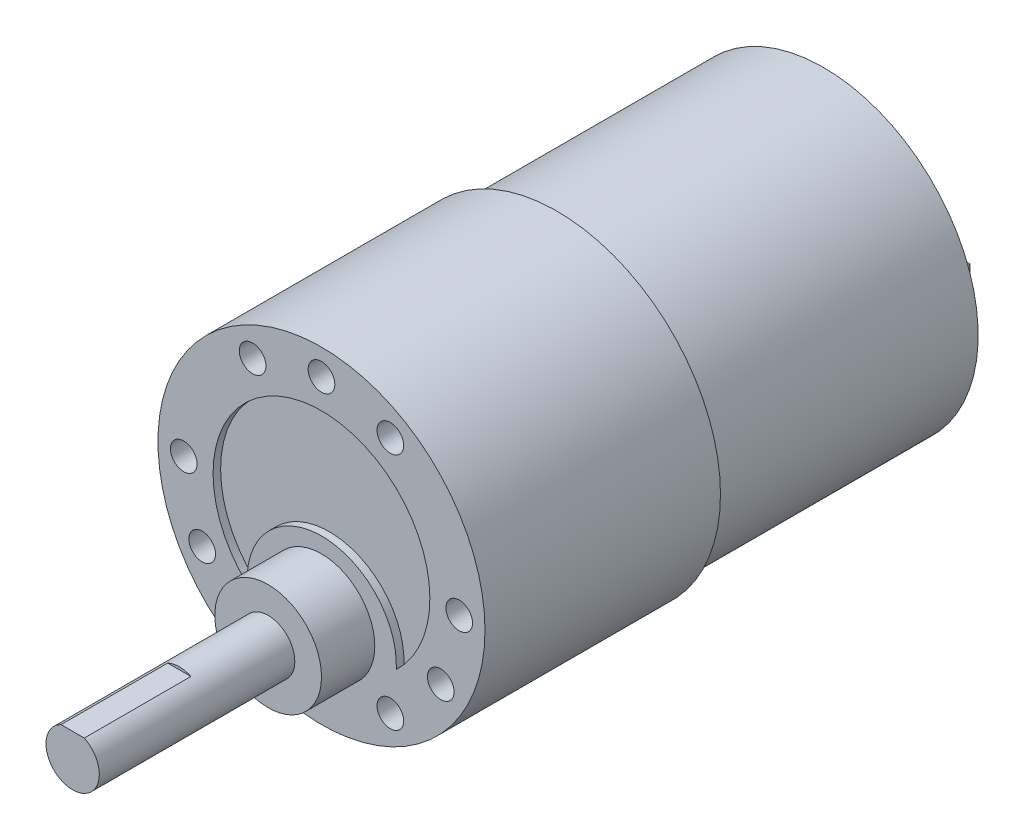
ISO-10303-21;
HEADER;
FILE_DESCRIPTION(('STEP AP214'),'2;1');
FILE_NAME('part.step','',(''),(''),'','','');
FILE_SCHEMA(('AUTOMOTIVE_DESIGN { 1 0 10303 214 1 1 1 1 }'));
ENDSEC;
DATA;
#1=APPLICATION_CONTEXT('core data for automotive mechanical design processes');
#2=APPLICATION_PROTOCOL_DEFINITION('international standard','automotive_design',2000,#1);
#3=PRODUCT_CONTEXT('',#1,'mechanical');
#4=PRODUCT('Part','Part','',(#3));
#5=PRODUCT_RELATED_PRODUCT_CATEGORY('part','',(#4));
#6=PRODUCT_DEFINITION_FORMATION('','',#4);
#7=PRODUCT_DEFINITION_CONTEXT('part definition',#1,'design');
#8=PRODUCT_DEFINITION('design','',#6,#7);
#9=PRODUCT_DEFINITION_SHAPE('','',#8);
#10=(LENGTH_UNIT() NAMED_UNIT(*) SI_UNIT(.MILLI.,.METRE.));
#11=(NAMED_UNIT(*) PLANE_ANGLE_UNIT() SI_UNIT($,.RADIAN.));
#12=(NAMED_UNIT(*) SI_UNIT($,.STERADIAN.) SOLID_ANGLE_UNIT());
#13=UNCERTAINTY_MEASURE_WITH_UNIT(LENGTH_MEASURE(1.E-05),#10,'distance_accuracy_value','');
#14=(GEOMETRIC_REPRESENTATION_CONTEXT(3) GLOBAL_UNCERTAINTY_ASSIGNED_CONTEXT((#13)) GLOBAL_UNIT_ASSIGNED_CONTEXT((#10,
#11,#12)) REPRESENTATION_CONTEXT('',''));
#15=CARTESIAN_POINT('',(0.,0.,0.));
#16=DIRECTION('',(0.,0.,1.));
#17=DIRECTION('',(1.,0.,0.));
#18=AXIS2_PLACEMENT_3D('',#15,#16,#17);
#19=CARTESIAN_POINT('',(0.,0.,-30.));
#20=DIRECTION('',(0.,0.,-1.));
#21=DIRECTION('',(-1.,0.,0.));
#22=AXIS2_PLACEMENT_3D('',#19,#20,#21);
#23=PLANE('',#22);
#24=CARTESIAN_POINT('',(11.25,0.,-30.));
#25=DIRECTION('',(0.,0.,-1.));
#26=DIRECTION('',(-1.,0.,0.));
#27=AXIS2_PLACEMENT_3D('',#24,#25,#26);
#28=CIRCLE('',#27,2.25);
#29=CARTESIAN_POINT('',(9.,0.,-30.));
#30=VERTEX_POINT('',#29);
#31=EDGE_CURVE('E227',#30,#30,#28,.T.);
#32=ORIENTED_EDGE('',*,*,#31,.F.);
#33=EDGE_LOOP('',(#32));
#34=FACE_BOUND('',#33,.T.);
#35=CARTESIAN_POINT('',(0.,0.,-30.));
#36=DIRECTION('',(0.,0.,-1.));
#37=DIRECTION('',(-1.,0.,0.));
#38=AXIS2_PLACEMENT_3D('',#35,#36,#37);
#39=CIRCLE('',#38,3.9);
#40=CARTESIAN_POINT('',(-3.9,0.,-30.));
#41=VERTEX_POINT('',#40);
#42=EDGE_CURVE('E14',#41,#41,#39,.T.);
#43=ORIENTED_EDGE('',*,*,#42,.F.);
#44=EDGE_LOOP('',(#43));
#45=FACE_BOUND('',#44,.T.);
#46=CARTESIAN_POINT('',(0.,0.,-30.));
#47=DIRECTION('',(0.,0.,-1.));
#48=DIRECTION('',(-1.,0.,0.));
#49=AXIS2_PLACEMENT_3D('',#46,#47,#48);
#50=CIRCLE('',#49,17.4);
#51=CARTESIAN_POINT('',(-17.4,0.,-30.));
#52=VERTEX_POINT('',#51);
#53=EDGE_CURVE('E235',#52,#52,#50,.T.);
#54=ORIENTED_EDGE('',*,*,#53,.T.);
#55=EDGE_LOOP('',(#54));
#56=FACE_BOUND('',#55,.T.);
#57=CARTESIAN_POINT('',(-11.25,0.,-30.));
#58=DIRECTION('',(0.,0.,-1.));
#59=DIRECTION('',(1.,0.,0.));
#60=AXIS2_PLACEMENT_3D('',#57,#58,#59);
#61=CIRCLE('',#60,2.25);
#62=CARTESIAN_POINT('',(-9.,0.,-30.));
#63=VERTEX_POINT('',#62);
#64=EDGE_CURVE('E209',#63,#63,#61,.T.);
#65=ORIENTED_EDGE('',*,*,#64,.F.);
#66=EDGE_LOOP('',(#65));
#67=FACE_BOUND('',#66,.T.);
#68=ADVANCED_FACE('F58',(#34,#45,#56,#67),#23,.T.);
#69=CARTESIAN_POINT('',(0.,0.,26.5));
#70=DIRECTION('',(0.,0.,-1.));
#71=DIRECTION('',(-1.,0.,0.));
#72=AXIS2_PLACEMENT_3D('',#69,#70,#71);
#73=CYLINDRICAL_SURFACE('',#72,18.4);
#74=CARTESIAN_POINT('',(0.,0.,26.5));
#75=DIRECTION('',(0.,0.,1.));
#76=DIRECTION('',(1.,0.,0.));
#77=AXIS2_PLACEMENT_3D('',#74,#75,#76);
#78=CIRCLE('',#77,18.4);
#79=CARTESIAN_POINT('',(18.4,0.,26.5));
#80=VERTEX_POINT('',#79);
#81=EDGE_CURVE('E259',#80,#80,#78,.T.);
#82=ORIENTED_EDGE('',*,*,#81,.F.);
#83=EDGE_LOOP('',(#82));
#84=FACE_BOUND('',#83,.T.);
#85=CARTESIAN_POINT('',(0.,0.,0.));
#86=DIRECTION('',(0.,0.,1.));
#87=DIRECTION('',(1.,0.,0.));
#88=AXIS2_PLACEMENT_3D('',#85,#86,#87);
#89=CIRCLE('',#88,18.4);
#90=CARTESIAN_POINT('',(18.4,0.,0.));
#91=VERTEX_POINT('',#90);
#92=EDGE_CURVE('E62',#91,#91,#89,.T.);
#93=ORIENTED_EDGE('',*,*,#92,.T.);
#94=EDGE_LOOP('',(#93));
#95=FACE_BOUND('',#94,.T.);
#96=ADVANCED_FACE('F60',(#84,#95),#73,.T.);
#97=CARTESIAN_POINT('',(0.,0.,26.5));
#98=DIRECTION('',(0.,0.,1.));
#99=DIRECTION('',(1.,0.,0.));
#100=AXIS2_PLACEMENT_3D('',#97,#98,#99);
#101=PLANE('',#100);
#102=CARTESIAN_POINT('',(-1.78589781851884E-12,-7.75000000000207,26.5));
#103=DIRECTION('',(0.,0.,1.));
#104=DIRECTION('',(1.,0.,0.));
#105=AXIS2_PLACEMENT_3D('',#102,#103,#104);
#106=CIRCLE('',#105,6.);
#107=CARTESIAN_POINT('',(5.99999999999821,-7.75000000000207,26.5));
#108=VERTEX_POINT('',#107);
#109=EDGE_CURVE('E256',#108,#108,#106,.T.);
#110=ORIENTED_EDGE('',*,*,#109,.F.);
#111=EDGE_LOOP('',(#110));
#112=FACE_BOUND('',#111,.T.);
#113=CARTESIAN_POINT('',(-15.5,0.,26.5));
#114=DIRECTION('',(0.,0.,1.));
#115=DIRECTION('',(1.,0.,0.));
#116=AXIS2_PLACEMENT_3D('',#113,#114,#115);
#117=CIRCLE('',#116,1.5);
#118=CARTESIAN_POINT('',(-14.,0.,26.5));
#119=VERTEX_POINT('',#118);
#120=EDGE_CURVE('E270',#119,#119,#117,.T.);
#121=ORIENTED_EDGE('',*,*,#120,.F.);
#122=EDGE_LOOP('',(#121));
#123=FACE_BOUND('',#122,.T.);
#124=CARTESIAN_POINT('',(-7.75000000000016,-13.4233937586587,26.5));
#125=DIRECTION('',(0.,0.,1.));
#126=DIRECTION('',(1.,0.,0.));
#127=AXIS2_PLACEMENT_3D('',#124,#125,#126);
#128=CIRCLE('',#127,1.5);
#129=CARTESIAN_POINT('',(-6.25000000000015,-13.4233937586587,26.5));
#130=VERTEX_POINT('',#129);
#131=EDGE_CURVE('E263',#130,#130,#128,.T.);
#132=ORIENTED_EDGE('',*,*,#131,.F.);
#133=EDGE_LOOP('',(#132));
#134=FACE_BOUND('',#133,.T.);
#135=CARTESIAN_POINT('',(7.74999999999987,-13.4233937586589,26.5));
#136=DIRECTION('',(0.,0.,1.));
#137=DIRECTION('',(1.,0.,0.));
#138=AXIS2_PLACEMENT_3D('',#135,#136,#137);
#139=CIRCLE('',#138,1.5);
#140=CARTESIAN_POINT('',(9.24999999999988,-13.4233937586589,26.5));
#141=VERTEX_POINT('',#140);
#142=EDGE_CURVE('E277',#141,#141,#139,.T.);
#143=ORIENTED_EDGE('',*,*,#142,.F.);
#144=EDGE_LOOP('',(#143));
#145=FACE_BOUND('',#144,.T.);
#146=CARTESIAN_POINT('',(15.5,-1.08235921504137E-13,26.5));
#147=DIRECTION('',(0.,0.,1.));
#148=DIRECTION('',(1.,0.,0.));
#149=AXIS2_PLACEMENT_3D('',#146,#147,#148);
#150=CIRCLE('',#149,1.5);
#151=CARTESIAN_POINT('',(17.,-1.08235921504137E-13,26.5));
#152=VERTEX_POINT('',#151);
#153=EDGE_CURVE('E294',#152,#152,#150,.T.);
#154=ORIENTED_EDGE('',*,*,#153,.F.);
#155=EDGE_LOOP('',(#154));
#156=FACE_BOUND('',#155,.T.);
#157=CARTESIAN_POINT('',(7.75000000000006,13.4233937586588,26.5));
#158=DIRECTION('',(0.,0.,1.));
#159=DIRECTION('',(1.,0.,0.));
#160=AXIS2_PLACEMENT_3D('',#157,#158,#159);
#161=CIRCLE('',#160,1.5);
#162=CARTESIAN_POINT('',(9.25000000000006,13.4233937586588,26.5));
#163=VERTEX_POINT('',#162);
#164=EDGE_CURVE('E288',#163,#163,#161,.T.);
#165=ORIENTED_EDGE('',*,*,#164,.F.);
#166=EDGE_LOOP('',(#165));
#167=FACE_BOUND('',#166,.T.);
#168=CARTESIAN_POINT('',(-7.74999999999997,13.4233937586588,26.5));
#169=DIRECTION('',(0.,0.,1.));
#170=DIRECTION('',(1.,0.,0.));
#171=AXIS2_PLACEMENT_3D('',#168,#169,#170);
#172=CIRCLE('',#171,1.5);
#173=CARTESIAN_POINT('',(-6.24999999999997,13.4233937586588,26.5));
#174=VERTEX_POINT('',#173);
#175=EDGE_CURVE('E282',#174,#174,#172,.T.);
#176=ORIENTED_EDGE('',*,*,#175,.F.);
#177=EDGE_LOOP('',(#176));
#178=FACE_BOUND('',#177,.T.);
#179=CARTESIAN_POINT('',(0.,15.5,26.5));
#180=DIRECTION('',(0.,0.,1.));
#181=DIRECTION('',(1.,0.,0.));
#182=AXIS2_PLACEMENT_3D('',#179,#180,#181);
#183=CIRCLE('',#182,1.5);
#184=CARTESIAN_POINT('',(1.5,15.5,26.5));
#185=VERTEX_POINT('',#184);
#186=EDGE_CURVE('E306',#185,#185,#183,.T.);
#187=ORIENTED_EDGE('',*,*,#186,.F.);
#188=EDGE_LOOP('',(#187));
#189=FACE_BOUND('',#188,.T.);
#190=CARTESIAN_POINT('',(13.4233937586576,-7.75000000000207,26.5));
#191=DIRECTION('',(0.,0.,1.));
#192=DIRECTION('',(1.,0.,0.));
#193=AXIS2_PLACEMENT_3D('',#190,#191,#192);
#194=CIRCLE('',#193,1.49999999999779);
#195=CARTESIAN_POINT('',(14.9233937586554,-7.75000000000207,26.5));
#196=VERTEX_POINT('',#195);
#197=EDGE_CURVE('E312',#196,#196,#194,.T.);
#198=ORIENTED_EDGE('',*,*,#197,.F.);
#199=EDGE_LOOP('',(#198));
#200=FACE_BOUND('',#199,.T.);
#201=CARTESIAN_POINT('',(-13.4233937586612,-7.74999999999587,26.5));
#202=DIRECTION('',(0.,0.,1.));
#203=DIRECTION('',(1.,0.,0.));
#204=AXIS2_PLACEMENT_3D('',#201,#202,#203);
#205=CIRCLE('',#204,1.49999999999558);
#206=CARTESIAN_POINT('',(-11.9233937586656,-7.74999999999587,26.5));
#207=VERTEX_POINT('',#206);
#208=EDGE_CURVE('E269',#207,#207,#205,.T.);
#209=ORIENTED_EDGE('',*,*,#208,.F.);
#210=EDGE_LOOP('',(#209));
#211=FACE_BOUND('',#210,.T.);
#212=CARTESIAN_POINT('',(0.0300122031200254,-8.39994638480889,26.5));
#213=DIRECTION('',(0.,0.,1.));
#214=DIRECTION('',(1.,0.,0.));
#215=AXIS2_PLACEMENT_3D('',#212,#213,#214);
#216=CIRCLE('',#215,8.4);
#217=CARTESIAN_POINT('',(-8.35571384552702,-8.88943452260424,26.5));
#218=VERTEX_POINT('',#217);
#219=CARTESIAN_POINT('',(8.41902189984086,-8.8295,26.5));
#220=VERTEX_POINT('',#219);
#221=EDGE_CURVE('E83',#218,#220,#216,.F.);
#222=ORIENTED_EDGE('',*,*,#221,.F.);
#223=CARTESIAN_POINT('',(0.,0.,26.5));
#224=DIRECTION('',(0.,0.,1.));
#225=DIRECTION('',(1.,0.,0.));
#226=AXIS2_PLACEMENT_3D('',#223,#224,#225);
#227=CIRCLE('',#226,12.2);
#228=EDGE_CURVE('E305',#220,#218,#227,.T.);
#229=ORIENTED_EDGE('',*,*,#228,.F.);
#230=EDGE_LOOP('',(#222,#229));
#231=FACE_BOUND('',#230,.T.);
#232=ORIENTED_EDGE('',*,*,#81,.T.);
#233=EDGE_LOOP('',(#232));
#234=FACE_BOUND('',#233,.T.);
#235=ADVANCED_FACE('F342',(#112,#123,#134,#145,#156,#167,#178,#189,#200,#211,#231,#234),#101,.T.);
#236=CARTESIAN_POINT('',(0.,0.,0.));
#237=DIRECTION('',(0.,0.,1.));
#238=DIRECTION('',(1.,0.,0.));
#239=AXIS2_PLACEMENT_3D('',#236,#237,#238);
#240=PLANE('',#239);
#241=CARTESIAN_POINT('',(0.,0.,0.));
#242=DIRECTION('',(0.,0.,-1.));
#243=DIRECTION('',(-1.,0.,0.));
#244=AXIS2_PLACEMENT_3D('',#241,#242,#243);
#245=CIRCLE('',#244,17.4);
#246=CARTESIAN_POINT('',(-17.4,0.,0.));
#247=VERTEX_POINT('',#246);
#248=EDGE_CURVE('E67',#247,#247,#245,.T.);
#249=ORIENTED_EDGE('',*,*,#248,.F.);
#250=EDGE_LOOP('',(#249));
#251=FACE_BOUND('',#250,.T.);
#252=ORIENTED_EDGE('',*,*,#92,.F.);
#253=EDGE_LOOP('',(#252));
#254=FACE_BOUND('',#253,.T.);
#255=ADVANCED_FACE('F339',(#251,#254),#240,.F.);
#256=CARTESIAN_POINT('',(0.0300122031200254,-8.39994638480889,25.65));
#257=DIRECTION('',(0.,0.,1.));
#258=DIRECTION('',(1.,0.,0.));
#259=AXIS2_PLACEMENT_3D('',#256,#257,#258);
#260=CYLINDRICAL_SURFACE('',#259,8.4);
#261=ORIENTED_EDGE('',*,*,#221,.T.);
#262=DIRECTION('',(0.,0.,1.));
#263=VECTOR('',#262,1.);
#264=CARTESIAN_POINT('',(8.41902189984086,-8.8295,25.65));
#265=LINE('',#264,#263);
#266=CARTESIAN_POINT('',(8.41902189984086,-8.8295,25.65));
#267=VERTEX_POINT('',#266);
#268=EDGE_CURVE('E330',#267,#220,#265,.T.);
#269=ORIENTED_EDGE('',*,*,#268,.F.);
#270=CARTESIAN_POINT('',(0.0300122031200254,-8.39994638480889,25.65));
#271=DIRECTION('',(0.,0.,1.));
#272=DIRECTION('',(1.,0.,0.));
#273=AXIS2_PLACEMENT_3D('',#270,#271,#272);
#274=CIRCLE('',#273,8.4);
#275=CARTESIAN_POINT('',(-8.35571384552702,-8.88943452260424,25.65));
#276=VERTEX_POINT('',#275);
#277=EDGE_CURVE('E323',#276,#267,#274,.F.);
#278=ORIENTED_EDGE('',*,*,#277,.F.);
#279=DIRECTION('',(0.,0.,1.));
#280=VECTOR('',#279,1.);
#281=CARTESIAN_POINT('',(-8.35571384552702,-8.88943452260424,25.65));
#282=LINE('',#281,#280);
#283=EDGE_CURVE('E326',#276,#218,#282,.T.);
#284=ORIENTED_EDGE('',*,*,#283,.T.);
#285=EDGE_LOOP('',(#261,#269,#278,#284));
#286=FACE_BOUND('',#285,.T.);
#287=ADVANCED_FACE('F341',(#286),#260,.T.);
#288=CARTESIAN_POINT('',(0.,0.,25.65));
#289=DIRECTION('',(0.,0.,1.));
#290=DIRECTION('',(1.,0.,0.));
#291=AXIS2_PLACEMENT_3D('',#288,#289,#290);
#292=CYLINDRICAL_SURFACE('',#291,12.2);
#293=ORIENTED_EDGE('',*,*,#228,.T.);
#294=ORIENTED_EDGE('',*,*,#283,.F.);
#295=CARTESIAN_POINT('',(0.,0.,25.65));
#296=DIRECTION('',(0.,0.,1.));
#297=DIRECTION('',(1.,0.,0.));
#298=AXIS2_PLACEMENT_3D('',#295,#296,#297);
#299=CIRCLE('',#298,12.2);
#300=EDGE_CURVE('E320',#267,#276,#299,.T.);
#301=ORIENTED_EDGE('',*,*,#300,.F.);
#302=ORIENTED_EDGE('',*,*,#268,.T.);
#303=EDGE_LOOP('',(#293,#294,#301,#302));
#304=FACE_BOUND('',#303,.T.);
#305=ADVANCED_FACE('F348',(#304),#292,.F.);
#306=CARTESIAN_POINT('',(0.,0.,25.65));
#307=DIRECTION('',(0.,0.,1.));
#308=DIRECTION('',(1.,0.,0.));
#309=AXIS2_PLACEMENT_3D('',#306,#307,#308);
#310=PLANE('',#309);
#311=ORIENTED_EDGE('',*,*,#300,.T.);
#312=ORIENTED_EDGE('',*,*,#277,.T.);
#313=EDGE_LOOP('',(#311,#312));
#314=FACE_BOUND('',#313,.T.);
#315=ADVANCED_FACE('F464',(#314),#310,.T.);
#316=CARTESIAN_POINT('',(-13.4233937586612,-7.74999999999587,1.5));
#317=DIRECTION('',(0.,0.,1.));
#318=DIRECTION('',(1.,0.,0.));
#319=AXIS2_PLACEMENT_3D('',#316,#317,#318);
#320=CYLINDRICAL_SURFACE('',#319,1.49999999999558);
#321=CARTESIAN_POINT('',(-13.4233937586612,-7.74999999999587,1.5));
#322=DIRECTION('',(0.,0.,1.));
#323=DIRECTION('',(1.,0.,0.));
#324=AXIS2_PLACEMENT_3D('',#321,#322,#323);
#325=CIRCLE('',#324,1.49999999999558);
#326=CARTESIAN_POINT('',(-11.9233937586656,-7.74999999999587,1.5));
#327=VERTEX_POINT('',#326);
#328=EDGE_CURVE('E315',#327,#327,#325,.T.);
#329=ORIENTED_EDGE('',*,*,#328,.F.);
#330=EDGE_LOOP('',(#329));
#331=FACE_BOUND('',#330,.T.);
#332=ORIENTED_EDGE('',*,*,#208,.T.);
#333=EDGE_LOOP('',(#332));
#334=FACE_BOUND('',#333,.T.);
#335=ADVANCED_FACE('F460',(#331,#334),#320,.F.);
#336=CARTESIAN_POINT('',(-13.4233937586612,-7.74999999999587,1.5));
#337=DIRECTION('',(0.,0.,1.));
#338=DIRECTION('',(1.,0.,0.));
#339=AXIS2_PLACEMENT_3D('',#336,#337,#338);
#340=PLANE('',#339);
#341=ORIENTED_EDGE('',*,*,#328,.T.);
#342=EDGE_LOOP('',(#341));
#343=FACE_BOUND('',#342,.T.);
#344=ADVANCED_FACE('F456',(#343),#340,.T.);
#345=CARTESIAN_POINT('',(13.4233937586576,-7.75000000000207,1.5));
#346=DIRECTION('',(0.,0.,1.));
#347=DIRECTION('',(1.,0.,0.));
#348=AXIS2_PLACEMENT_3D('',#345,#346,#347);
#349=CYLINDRICAL_SURFACE('',#348,1.49999999999779);
#350=CARTESIAN_POINT('',(13.4233937586576,-7.75000000000207,1.5));
#351=DIRECTION('',(0.,0.,1.));
#352=DIRECTION('',(1.,0.,0.));
#353=AXIS2_PLACEMENT_3D('',#350,#351,#352);
#354=CIRCLE('',#353,1.49999999999779);
#355=CARTESIAN_POINT('',(14.9233937586554,-7.75000000000207,1.5));
#356=VERTEX_POINT('',#355);
#357=EDGE_CURVE('E309',#356,#356,#354,.T.);
#358=ORIENTED_EDGE('',*,*,#357,.F.);
#359=EDGE_LOOP('',(#358));
#360=FACE_BOUND('',#359,.T.);
#361=ORIENTED_EDGE('',*,*,#197,.T.);
#362=EDGE_LOOP('',(#361));
#363=FACE_BOUND('',#362,.T.);
#364=ADVANCED_FACE('F452',(#360,#363),#349,.F.);
#365=CARTESIAN_POINT('',(13.4233937586576,-7.75000000000207,1.5));
#366=DIRECTION('',(0.,0.,1.));
#367=DIRECTION('',(1.,0.,0.));
#368=AXIS2_PLACEMENT_3D('',#365,#366,#367);
#369=PLANE('',#368);
#370=ORIENTED_EDGE('',*,*,#357,.T.);
#371=EDGE_LOOP('',(#370));
#372=FACE_BOUND('',#371,.T.);
#373=ADVANCED_FACE('F448',(#372),#369,.T.);
#374=CARTESIAN_POINT('',(0.,15.5,1.5));
#375=DIRECTION('',(0.,0.,1.));
#376=DIRECTION('',(1.,0.,0.));
#377=AXIS2_PLACEMENT_3D('',#374,#375,#376);
#378=CYLINDRICAL_SURFACE('',#377,1.5);
#379=CARTESIAN_POINT('',(0.,15.5,1.5));
#380=DIRECTION('',(0.,0.,1.));
#381=DIRECTION('',(1.,0.,0.));
#382=AXIS2_PLACEMENT_3D('',#379,#380,#381);
#383=CIRCLE('',#382,1.5);
#384=CARTESIAN_POINT('',(1.5,15.5,1.5));
#385=VERTEX_POINT('',#384);
#386=EDGE_CURVE('E302',#385,#385,#383,.T.);
#387=ORIENTED_EDGE('',*,*,#386,.F.);
#388=EDGE_LOOP('',(#387));
#389=FACE_BOUND('',#388,.T.);
#390=ORIENTED_EDGE('',*,*,#186,.T.);
#391=EDGE_LOOP('',(#390));
#392=FACE_BOUND('',#391,.T.);
#393=ADVANCED_FACE('F444',(#389,#392),#378,.F.);
#394=CARTESIAN_POINT('',(0.,15.5,1.5));
#395=DIRECTION('',(0.,0.,1.));
#396=DIRECTION('',(1.,0.,0.));
#397=AXIS2_PLACEMENT_3D('',#394,#395,#396);
#398=PLANE('',#397);
#399=ORIENTED_EDGE('',*,*,#386,.T.);
#400=EDGE_LOOP('',(#399));
#401=FACE_BOUND('',#400,.T.);
#402=ADVANCED_FACE('F418',(#401),#398,.T.);
#403=CARTESIAN_POINT('',(-7.74999999999997,13.4233937586588,21.5));
#404=DIRECTION('',(0.,0.,1.));
#405=DIRECTION('',(1.,0.,0.));
#406=AXIS2_PLACEMENT_3D('',#403,#404,#405);
#407=CYLINDRICAL_SURFACE('',#406,1.5);
#408=CARTESIAN_POINT('',(-7.74999999999997,13.4233937586588,21.5));
#409=DIRECTION('',(0.,0.,1.));
#410=DIRECTION('',(1.,0.,0.));
#411=AXIS2_PLACEMENT_3D('',#408,#409,#410);
#412=CIRCLE('',#411,1.5);
#413=CARTESIAN_POINT('',(-6.24999999999997,13.4233937586588,21.5));
#414=VERTEX_POINT('',#413);
#415=EDGE_CURVE('E273',#414,#414,#412,.T.);
#416=ORIENTED_EDGE('',*,*,#415,.F.);
#417=EDGE_LOOP('',(#416));
#418=FACE_BOUND('',#417,.T.);
#419=ORIENTED_EDGE('',*,*,#175,.T.);
#420=EDGE_LOOP('',(#419));
#421=FACE_BOUND('',#420,.T.);
#422=ADVANCED_FACE('F414',(#418,#421),#407,.F.);
#423=CARTESIAN_POINT('',(-7.74999999999997,13.4233937586588,21.5));
#424=DIRECTION('',(0.,0.,1.));
#425=DIRECTION('',(1.,0.,0.));
#426=AXIS2_PLACEMENT_3D('',#423,#424,#425);
#427=PLANE('',#426);
#428=ORIENTED_EDGE('',*,*,#415,.T.);
#429=EDGE_LOOP('',(#428));
#430=FACE_BOUND('',#429,.T.);
#431=ADVANCED_FACE('F410',(#430),#427,.T.);
#432=CARTESIAN_POINT('',(7.75000000000006,13.4233937586588,21.5));
#433=DIRECTION('',(0.,0.,1.));
#434=DIRECTION('',(1.,0.,0.));
#435=AXIS2_PLACEMENT_3D('',#432,#433,#434);
#436=CYLINDRICAL_SURFACE('',#435,1.5);
#437=CARTESIAN_POINT('',(7.75000000000006,13.4233937586588,21.5));
#438=DIRECTION('',(0.,0.,1.));
#439=DIRECTION('',(1.,0.,0.));
#440=AXIS2_PLACEMENT_3D('',#437,#438,#439);
#441=CIRCLE('',#440,1.5);
#442=CARTESIAN_POINT('',(9.25000000000006,13.4233937586588,21.5));
#443=VERTEX_POINT('',#442);
#444=EDGE_CURVE('E285',#443,#443,#441,.T.);
#445=ORIENTED_EDGE('',*,*,#444,.F.);
#446=EDGE_LOOP('',(#445));
#447=FACE_BOUND('',#446,.T.);
#448=ORIENTED_EDGE('',*,*,#164,.T.);
#449=EDGE_LOOP('',(#448));
#450=FACE_BOUND('',#449,.T.);
#451=ADVANCED_FACE('F413',(#447,#450),#436,.F.);
#452=CARTESIAN_POINT('',(7.75000000000006,13.4233937586588,21.5));
#453=DIRECTION('',(0.,0.,1.));
#454=DIRECTION('',(1.,0.,0.));
#455=AXIS2_PLACEMENT_3D('',#452,#453,#454);
#456=PLANE('',#455);
#457=ORIENTED_EDGE('',*,*,#444,.T.);
#458=EDGE_LOOP('',(#457));
#459=FACE_BOUND('',#458,.T.);
#460=ADVANCED_FACE('F420',(#459),#456,.T.);
#461=CARTESIAN_POINT('',(15.5,-1.08235921504137E-13,21.5));
#462=DIRECTION('',(0.,0.,1.));
#463=DIRECTION('',(1.,0.,0.));
#464=AXIS2_PLACEMENT_3D('',#461,#462,#463);
#465=CYLINDRICAL_SURFACE('',#464,1.5);
#466=CARTESIAN_POINT('',(15.5,-1.08235921504137E-13,21.5));
#467=DIRECTION('',(0.,0.,1.));
#468=DIRECTION('',(1.,0.,0.));
#469=AXIS2_PLACEMENT_3D('',#466,#467,#468);
#470=CIRCLE('',#469,1.5);
#471=CARTESIAN_POINT('',(17.,-1.08235921504137E-13,21.5));
#472=VERTEX_POINT('',#471);
#473=EDGE_CURVE('E291',#472,#472,#470,.T.);
#474=ORIENTED_EDGE('',*,*,#473,.F.);
#475=EDGE_LOOP('',(#474));
#476=FACE_BOUND('',#475,.T.);
#477=ORIENTED_EDGE('',*,*,#153,.T.);
#478=EDGE_LOOP('',(#477));
#479=FACE_BOUND('',#478,.T.);
#480=ADVANCED_FACE('F423',(#476,#479),#465,.F.);
#481=CARTESIAN_POINT('',(15.5,-1.08235921504137E-13,21.5));
#482=DIRECTION('',(0.,0.,1.));
#483=DIRECTION('',(1.,0.,0.));
#484=AXIS2_PLACEMENT_3D('',#481,#482,#483);
#485=PLANE('',#484);
#486=ORIENTED_EDGE('',*,*,#473,.T.);
#487=EDGE_LOOP('',(#486));
#488=FACE_BOUND('',#487,.T.);
#489=ADVANCED_FACE('F428',(#488),#485,.T.);
#490=CARTESIAN_POINT('',(7.74999999999987,-13.4233937586589,21.5));
#491=DIRECTION('',(0.,0.,1.));
#492=DIRECTION('',(1.,0.,0.));
#493=AXIS2_PLACEMENT_3D('',#490,#491,#492);
#494=CYLINDRICAL_SURFACE('',#493,1.5);
#495=CARTESIAN_POINT('',(7.74999999999987,-13.4233937586589,21.5));
#496=DIRECTION('',(0.,0.,1.));
#497=DIRECTION('',(1.,0.,0.));
#498=AXIS2_PLACEMENT_3D('',#495,#496,#497);
#499=CIRCLE('',#498,1.5);
#500=CARTESIAN_POINT('',(9.24999999999988,-13.4233937586589,21.5));
#501=VERTEX_POINT('',#500);
#502=EDGE_CURVE('E297',#501,#501,#499,.T.);
#503=ORIENTED_EDGE('',*,*,#502,.F.);
#504=EDGE_LOOP('',(#503));
#505=FACE_BOUND('',#504,.T.);
#506=ORIENTED_EDGE('',*,*,#142,.T.);
#507=EDGE_LOOP('',(#506));
#508=FACE_BOUND('',#507,.T.);
#509=ADVANCED_FACE('F431',(#505,#508),#494,.F.);
#510=CARTESIAN_POINT('',(7.74999999999987,-13.4233937586589,21.5));
#511=DIRECTION('',(0.,0.,1.));
#512=DIRECTION('',(1.,0.,0.));
#513=AXIS2_PLACEMENT_3D('',#510,#511,#512);
#514=PLANE('',#513);
#515=ORIENTED_EDGE('',*,*,#502,.T.);
#516=EDGE_LOOP('',(#515));
#517=FACE_BOUND('',#516,.T.);
#518=ADVANCED_FACE('F408',(#517),#514,.T.);
#519=CARTESIAN_POINT('',(-7.75000000000016,-13.4233937586587,21.5));
#520=DIRECTION('',(0.,0.,1.));
#521=DIRECTION('',(1.,0.,0.));
#522=AXIS2_PLACEMENT_3D('',#519,#520,#521);
#523=CYLINDRICAL_SURFACE('',#522,1.5);
#524=CARTESIAN_POINT('',(-7.75000000000016,-13.4233937586587,21.5));
#525=DIRECTION('',(0.,0.,1.));
#526=DIRECTION('',(1.,0.,0.));
#527=AXIS2_PLACEMENT_3D('',#524,#525,#526);
#528=CIRCLE('',#527,1.5);
#529=CARTESIAN_POINT('',(-6.25000000000015,-13.4233937586587,21.5));
#530=VERTEX_POINT('',#529);
#531=EDGE_CURVE('E274',#530,#530,#528,.T.);
#532=ORIENTED_EDGE('',*,*,#531,.F.);
#533=EDGE_LOOP('',(#532));
#534=FACE_BOUND('',#533,.T.);
#535=ORIENTED_EDGE('',*,*,#131,.T.);
#536=EDGE_LOOP('',(#535));
#537=FACE_BOUND('',#536,.T.);
#538=ADVANCED_FACE('F404',(#534,#537),#523,.F.);
#539=CARTESIAN_POINT('',(-7.75000000000016,-13.4233937586587,21.5));
#540=DIRECTION('',(0.,0.,1.));
#541=DIRECTION('',(1.,0.,0.));
#542=AXIS2_PLACEMENT_3D('',#539,#540,#541);
#543=PLANE('',#542);
#544=ORIENTED_EDGE('',*,*,#531,.T.);
#545=EDGE_LOOP('',(#544));
#546=FACE_BOUND('',#545,.T.);
#547=ADVANCED_FACE('F400',(#546),#543,.T.);
#548=CARTESIAN_POINT('',(-15.5,0.,21.5));
#549=DIRECTION('',(0.,0.,1.));
#550=DIRECTION('',(1.,0.,0.));
#551=AXIS2_PLACEMENT_3D('',#548,#549,#550);
#552=CYLINDRICAL_SURFACE('',#551,1.5);
#553=CARTESIAN_POINT('',(-15.5,0.,21.5));
#554=DIRECTION('',(0.,0.,1.));
#555=DIRECTION('',(1.,0.,0.));
#556=AXIS2_PLACEMENT_3D('',#553,#554,#555);
#557=CIRCLE('',#556,1.5);
#558=CARTESIAN_POINT('',(-14.,0.,21.5));
#559=VERTEX_POINT('',#558);
#560=EDGE_CURVE('E266',#559,#559,#557,.T.);
#561=ORIENTED_EDGE('',*,*,#560,.F.);
#562=EDGE_LOOP('',(#561));
#563=FACE_BOUND('',#562,.T.);
#564=ORIENTED_EDGE('',*,*,#120,.T.);
#565=EDGE_LOOP('',(#564));
#566=FACE_BOUND('',#565,.T.);
#567=ADVANCED_FACE('F396',(#563,#566),#552,.F.);
#568=CARTESIAN_POINT('',(-15.5,0.,21.5));
#569=DIRECTION('',(0.,0.,1.));
#570=DIRECTION('',(1.,0.,0.));
#571=AXIS2_PLACEMENT_3D('',#568,#569,#570);
#572=PLANE('',#571);
#573=ORIENTED_EDGE('',*,*,#560,.T.);
#574=EDGE_LOOP('',(#573));
#575=FACE_BOUND('',#574,.T.);
#576=ADVANCED_FACE('F392',(#575),#572,.T.);
#577=CARTESIAN_POINT('',(-1.78589781851884E-12,-7.75000000000207,32.5));
#578=DIRECTION('',(0.,0.,-1.));
#579=DIRECTION('',(-1.,0.,0.));
#580=AXIS2_PLACEMENT_3D('',#577,#578,#579);
#581=CYLINDRICAL_SURFACE('',#580,6.);
#582=CARTESIAN_POINT('',(-1.78589781851884E-12,-7.75000000000207,32.5));
#583=DIRECTION('',(0.,0.,1.));
#584=DIRECTION('',(1.,0.,0.));
#585=AXIS2_PLACEMENT_3D('',#582,#583,#584);
#586=CIRCLE('',#585,6.);
#587=CARTESIAN_POINT('',(5.99999999999821,-7.75000000000207,32.5));
#588=VERTEX_POINT('',#587);
#589=EDGE_CURVE('E260',#588,#588,#586,.T.);
#590=ORIENTED_EDGE('',*,*,#589,.F.);
#591=EDGE_LOOP('',(#590));
#592=FACE_BOUND('',#591,.T.);
#593=ORIENTED_EDGE('',*,*,#109,.T.);
#594=EDGE_LOOP('',(#593));
#595=FACE_BOUND('',#594,.T.);
#596=ADVANCED_FACE('F388',(#592,#595),#581,.T.);
#597=CARTESIAN_POINT('',(-1.78589781851884E-12,-7.75000000000207,32.5));
#598=DIRECTION('',(0.,0.,1.));
#599=DIRECTION('',(1.,0.,0.));
#600=AXIS2_PLACEMENT_3D('',#597,#598,#599);
#601=PLANE('',#600);
#602=CARTESIAN_POINT('',(-1.78589781851884E-12,-7.75000000000207,32.5));
#603=DIRECTION('',(0.,0.,1.));
#604=DIRECTION('',(1.,0.,0.));
#605=AXIS2_PLACEMENT_3D('',#602,#603,#604);
#606=CIRCLE('',#605,3.);
#607=CARTESIAN_POINT('',(2.99999999999821,-7.75000000000207,32.5));
#608=VERTEX_POINT('',#607);
#609=EDGE_CURVE('E242',#608,#608,#606,.T.);
#610=ORIENTED_EDGE('',*,*,#609,.F.);
#611=EDGE_LOOP('',(#610));
#612=FACE_BOUND('',#611,.T.);
#613=ORIENTED_EDGE('',*,*,#589,.T.);
#614=EDGE_LOOP('',(#613));
#615=FACE_BOUND('',#614,.T.);
#616=ADVANCED_FACE('F384',(#612,#615),#601,.T.);
#617=CARTESIAN_POINT('',(-1.78589781851884E-12,-7.75000000000207,54.5));
#618=DIRECTION('',(0.,0.,-1.));
#619=DIRECTION('',(-1.,0.,0.));
#620=AXIS2_PLACEMENT_3D('',#617,#618,#619);
#621=CYLINDRICAL_SURFACE('',#620,3.);
#622=CARTESIAN_POINT('',(-1.78589781851884E-12,-7.75000000000207,54.5));
#623=DIRECTION('',(0.,0.,1.));
#624=DIRECTION('',(1.,0.,0.));
#625=AXIS2_PLACEMENT_3D('',#622,#623,#624);
#626=CIRCLE('',#625,3.);
#627=CARTESIAN_POINT('',(-1.30766968306399,-5.05000000000207,54.5));
#628=VERTEX_POINT('',#627);
#629=CARTESIAN_POINT('',(1.30766968306042,-5.05000000000207,54.5));
#630=VERTEX_POINT('',#629);
#631=EDGE_CURVE('E252',#628,#630,#626,.T.);
#632=ORIENTED_EDGE('',*,*,#631,.F.);
#633=DIRECTION('',(0.,0.,1.));
#634=VECTOR('',#633,1.);
#635=CARTESIAN_POINT('',(-1.30766968306399,-5.05000000000207,42.5));
#636=LINE('',#635,#634);
#637=CARTESIAN_POINT('',(-1.30766968306399,-5.05000000000207,42.5));
#638=VERTEX_POINT('',#637);
#639=EDGE_CURVE('E75',#638,#628,#636,.T.);
#640=ORIENTED_EDGE('',*,*,#639,.F.);
#641=CARTESIAN_POINT('',(-1.78589781851884E-12,-7.75000000000207,42.5));
#642=DIRECTION('',(0.,0.,1.));
#643=DIRECTION('',(1.,0.,0.));
#644=AXIS2_PLACEMENT_3D('',#641,#642,#643);
#645=CIRCLE('',#644,3.);
#646=CARTESIAN_POINT('',(1.30766968306042,-5.05000000000207,42.5));
#647=VERTEX_POINT('',#646);
#648=EDGE_CURVE('E243',#647,#638,#645,.T.);
#649=ORIENTED_EDGE('',*,*,#648,.F.);
#650=DIRECTION('',(0.,0.,1.));
#651=VECTOR('',#650,1.);
#652=CARTESIAN_POINT('',(1.30766968306042,-5.05000000000207,42.5));
#653=LINE('',#652,#651);
#654=EDGE_CURVE('E249',#647,#630,#653,.T.);
#655=ORIENTED_EDGE('',*,*,#654,.T.);
#656=EDGE_LOOP('',(#632,#640,#649,#655));
#657=FACE_BOUND('',#656,.T.);
#658=ORIENTED_EDGE('',*,*,#609,.T.);
#659=EDGE_LOOP('',(#658));
#660=FACE_BOUND('',#659,.T.);
#661=ADVANCED_FACE('F380',(#657,#660),#621,.T.);
#662=CARTESIAN_POINT('',(-1.78589781851884E-12,-7.75000000000207,54.5));
#663=DIRECTION('',(0.,0.,1.));
#664=DIRECTION('',(1.,0.,0.));
#665=AXIS2_PLACEMENT_3D('',#662,#663,#664);
#666=PLANE('',#665);
#667=DIRECTION('',(1.,0.,0.));
#668=VECTOR('',#667,1.);
#669=CARTESIAN_POINT('',(0.,-5.05000000000207,54.5));
#670=LINE('',#669,#668);
#671=EDGE_CURVE('E239',#628,#630,#670,.T.);
#672=ORIENTED_EDGE('',*,*,#671,.F.);
#673=ORIENTED_EDGE('',*,*,#631,.T.);
#674=EDGE_LOOP('',(#672,#673));
#675=FACE_BOUND('',#674,.T.);
#676=ADVANCED_FACE('F377',(#675),#666,.T.);
#677=CARTESIAN_POINT('',(0.,-5.05000000000207,42.5));
#678=DIRECTION('',(0.,-1.,0.));
#679=DIRECTION('',(0.,0.,-1.));
#680=AXIS2_PLACEMENT_3D('',#677,#678,#679);
#681=PLANE('',#680);
#682=ORIENTED_EDGE('',*,*,#671,.T.);
#683=ORIENTED_EDGE('',*,*,#654,.F.);
#684=DIRECTION('',(1.,0.,0.));
#685=VECTOR('',#684,1.);
#686=CARTESIAN_POINT('',(0.,-5.05000000000207,42.5));
#687=LINE('',#686,#685);
#688=EDGE_CURVE('E245',#638,#647,#687,.T.);
#689=ORIENTED_EDGE('',*,*,#688,.F.);
#690=ORIENTED_EDGE('',*,*,#639,.T.);
#691=EDGE_LOOP('',(#682,#683,#689,#690));
#692=FACE_BOUND('',#691,.T.);
#693=ADVANCED_FACE('F373',(#692),#681,.F.);
#694=CARTESIAN_POINT('',(0.,0.,42.5));
#695=DIRECTION('',(0.,0.,1.));
#696=DIRECTION('',(1.,0.,0.));
#697=AXIS2_PLACEMENT_3D('',#694,#695,#696);
#698=PLANE('',#697);
#699=ORIENTED_EDGE('',*,*,#648,.T.);
#700=ORIENTED_EDGE('',*,*,#688,.T.);
#701=EDGE_LOOP('',(#699,#700));
#702=FACE_BOUND('',#701,.T.);
#703=ADVANCED_FACE('F369',(#702),#698,.T.);
#704=CARTESIAN_POINT('',(0.,0.,-30.));
#705=DIRECTION('',(0.,0.,1.));
#706=DIRECTION('',(1.,0.,0.));
#707=AXIS2_PLACEMENT_3D('',#704,#705,#706);
#708=CYLINDRICAL_SURFACE('',#707,17.4);
#709=ORIENTED_EDGE('',*,*,#53,.F.);
#710=EDGE_LOOP('',(#709));
#711=FACE_BOUND('',#710,.T.);
#712=ORIENTED_EDGE('',*,*,#248,.T.);
#713=EDGE_LOOP('',(#712));
#714=FACE_BOUND('',#713,.T.);
#715=ADVANCED_FACE('F366',(#711,#714),#708,.T.);
#716=CARTESIAN_POINT('',(0.,0.,-31.6));
#717=DIRECTION('',(0.,0.,1.));
#718=DIRECTION('',(1.,0.,0.));
#719=AXIS2_PLACEMENT_3D('',#716,#717,#718);
#720=CYLINDRICAL_SURFACE('',#719,3.9);
#721=CARTESIAN_POINT('',(0.,0.,-31.6));
#722=DIRECTION('',(0.,0.,-1.));
#723=DIRECTION('',(-1.,0.,0.));
#724=AXIS2_PLACEMENT_3D('',#721,#722,#723);
#725=CIRCLE('',#724,3.9);
#726=CARTESIAN_POINT('',(-3.9,0.,-31.6));
#727=VERTEX_POINT('',#726);
#728=EDGE_CURVE('E231',#727,#727,#725,.T.);
#729=ORIENTED_EDGE('',*,*,#728,.F.);
#730=EDGE_LOOP('',(#729));
#731=FACE_BOUND('',#730,.T.);
#732=ORIENTED_EDGE('',*,*,#42,.T.);
#733=EDGE_LOOP('',(#732));
#734=FACE_BOUND('',#733,.T.);
#735=ADVANCED_FACE('F364',(#731,#734),#720,.T.);
#736=CARTESIAN_POINT('',(0.,0.,-31.6));
#737=DIRECTION('',(0.,0.,-1.));
#738=DIRECTION('',(-1.,0.,0.));
#739=AXIS2_PLACEMENT_3D('',#736,#737,#738);
#740=PLANE('',#739);
#741=ORIENTED_EDGE('',*,*,#728,.T.);
#742=EDGE_LOOP('',(#741));
#743=FACE_BOUND('',#742,.T.);
#744=ADVANCED_FACE('F590',(#743),#740,.T.);
#745=CARTESIAN_POINT('',(11.25,0.,-31.6));
#746=DIRECTION('',(0.,0.,-1.));
#747=DIRECTION('',(-1.,0.,0.));
#748=AXIS2_PLACEMENT_3D('',#745,#746,#747);
#749=PLANE('',#748);
#750=CARTESIAN_POINT('',(11.25,0.,-31.6));
#751=DIRECTION('',(0.,0.,-1.));
#752=DIRECTION('',(-1.,0.,0.));
#753=AXIS2_PLACEMENT_3D('',#750,#751,#752);
#754=CIRCLE('',#753,2.25);
#755=CARTESIAN_POINT('',(9.,0.,-31.6));
#756=VERTEX_POINT('',#755);
#757=EDGE_CURVE('E228',#756,#756,#754,.T.);
#758=ORIENTED_EDGE('',*,*,#757,.T.);
#759=EDGE_LOOP('',(#758));
#760=FACE_BOUND('',#759,.T.);
#761=DIRECTION('',(1.,0.,0.));
#762=VECTOR('',#761,1.);
#763=CARTESIAN_POINT('',(11.5,1.50000000000001,-31.6));
#764=LINE('',#763,#762);
#765=CARTESIAN_POINT('',(11.,1.50000000000001,-31.6));
#766=VERTEX_POINT('',#765);
#767=CARTESIAN_POINT('',(11.5,1.50000000000001,-31.6));
#768=VERTEX_POINT('',#767);
#769=EDGE_CURVE('E218',#766,#768,#764,.T.);
#770=ORIENTED_EDGE('',*,*,#769,.F.);
#771=DIRECTION('',(0.,1.,0.));
#772=VECTOR('',#771,1.);
#773=CARTESIAN_POINT('',(11.,-1.5,-31.6));
#774=LINE('',#773,#772);
#775=CARTESIAN_POINT('',(11.,-1.5,-31.6));
#776=VERTEX_POINT('',#775);
#777=EDGE_CURVE('E213',#776,#766,#774,.T.);
#778=ORIENTED_EDGE('',*,*,#777,.F.);
#779=DIRECTION('',(-1.,0.,0.));
#780=VECTOR('',#779,1.);
#781=CARTESIAN_POINT('',(11.5,-1.5,-31.6));
#782=LINE('',#781,#780);
#783=CARTESIAN_POINT('',(11.5,-1.5,-31.6));
#784=VERTEX_POINT('',#783);
#785=EDGE_CURVE('E224',#784,#776,#782,.T.);
#786=ORIENTED_EDGE('',*,*,#785,.F.);
#787=DIRECTION('',(0.,-1.,0.));
#788=VECTOR('',#787,1.);
#789=CARTESIAN_POINT('',(11.5,-1.5,-31.6));
#790=LINE('',#789,#788);
#791=EDGE_CURVE('E221',#768,#784,#790,.T.);
#792=ORIENTED_EDGE('',*,*,#791,.F.);
#793=EDGE_LOOP('',(#770,#778,#786,#792));
#794=FACE_BOUND('',#793,.T.);
#795=ADVANCED_FACE('F597',(#760,#794),#749,.T.);
#796=CARTESIAN_POINT('',(11.25,0.,-31.6));
#797=DIRECTION('',(0.,0.,1.));
#798=DIRECTION('',(1.,0.,0.));
#799=AXIS2_PLACEMENT_3D('',#796,#797,#798);
#800=CYLINDRICAL_SURFACE('',#799,2.25);
#801=ORIENTED_EDGE('',*,*,#757,.F.);
#802=EDGE_LOOP('',(#801));
#803=FACE_BOUND('',#802,.T.);
#804=ORIENTED_EDGE('',*,*,#31,.T.);
#805=EDGE_LOOP('',(#804));
#806=FACE_BOUND('',#805,.T.);
#807=ADVANCED_FACE('F605',(#803,#806),#800,.T.);
#808=CARTESIAN_POINT('',(-11.25,0.,-31.6));
#809=DIRECTION('',(0.,0.,1.));
#810=DIRECTION('',(1.,0.,0.));
#811=AXIS2_PLACEMENT_3D('',#808,#809,#810);
#812=PLANE('',#811);
#813=CARTESIAN_POINT('',(-11.25,0.,-31.6));
#814=DIRECTION('',(0.,0.,-1.));
#815=DIRECTION('',(1.,0.,0.));
#816=AXIS2_PLACEMENT_3D('',#813,#814,#815);
#817=CIRCLE('',#816,2.25);
#818=CARTESIAN_POINT('',(-9.,0.,-31.6));
#819=VERTEX_POINT('',#818);
#820=EDGE_CURVE('E210',#819,#819,#817,.T.);
#821=ORIENTED_EDGE('',*,*,#820,.T.);
#822=EDGE_LOOP('',(#821));
#823=FACE_BOUND('',#822,.T.);
#824=DIRECTION('',(0.,1.,0.));
#825=VECTOR('',#824,1.);
#826=CARTESIAN_POINT('',(-11.5,-1.49999999999998,-31.6));
#827=LINE('',#826,#825);
#828=CARTESIAN_POINT('',(-11.5,-1.49999999999998,-31.6));
#829=VERTEX_POINT('',#828);
#830=CARTESIAN_POINT('',(-11.5,1.50000000000001,-31.6));
#831=VERTEX_POINT('',#830);
#832=EDGE_CURVE('E200',#829,#831,#827,.T.);
#833=ORIENTED_EDGE('',*,*,#832,.F.);
#834=DIRECTION('',(-1.,0.,0.));
#835=VECTOR('',#834,1.);
#836=CARTESIAN_POINT('',(-11.5,-1.49999999999998,-31.6));
#837=LINE('',#836,#835);
#838=CARTESIAN_POINT('',(-11.,-1.49999999999998,-31.6));
#839=VERTEX_POINT('',#838);
#840=EDGE_CURVE('E173',#839,#829,#837,.T.);
#841=ORIENTED_EDGE('',*,*,#840,.F.);
#842=DIRECTION('',(0.,-1.,0.));
#843=VECTOR('',#842,1.);
#844=CARTESIAN_POINT('',(-11.,-1.49999999999998,-31.6));
#845=LINE('',#844,#843);
#846=CARTESIAN_POINT('',(-11.,1.50000000000001,-31.6));
#847=VERTEX_POINT('',#846);
#848=EDGE_CURVE('E205',#847,#839,#845,.T.);
#849=ORIENTED_EDGE('',*,*,#848,.F.);
#850=DIRECTION('',(1.,0.,0.));
#851=VECTOR('',#850,1.);
#852=CARTESIAN_POINT('',(-11.5,1.50000000000001,-31.6));
#853=LINE('',#852,#851);
#854=EDGE_CURVE('E202',#831,#847,#853,.T.);
#855=ORIENTED_EDGE('',*,*,#854,.F.);
#856=EDGE_LOOP('',(#833,#841,#849,#855));
#857=FACE_BOUND('',#856,.T.);
#858=ADVANCED_FACE('F614',(#823,#857),#812,.F.);
#859=CARTESIAN_POINT('',(-11.25,0.,-31.6));
#860=DIRECTION('',(0.,0.,1.));
#861=DIRECTION('',(1.,0.,0.));
#862=AXIS2_PLACEMENT_3D('',#859,#860,#861);
#863=CYLINDRICAL_SURFACE('',#862,2.25);
#864=ORIENTED_EDGE('',*,*,#820,.F.);
#865=EDGE_LOOP('',(#864));
#866=FACE_BOUND('',#865,.T.);
#867=ORIENTED_EDGE('',*,*,#64,.T.);
#868=EDGE_LOOP('',(#867));
#869=FACE_BOUND('',#868,.T.);
#870=ADVANCED_FACE('F621',(#866,#869),#863,.T.);
#871=CARTESIAN_POINT('',(11.5,-1.5,-35.));
#872=DIRECTION('',(0.,1.,0.));
#873=DIRECTION('',(0.,0.,1.));
#874=AXIS2_PLACEMENT_3D('',#871,#872,#873);
#875=PLANE('',#874);
#876=ORIENTED_EDGE('',*,*,#785,.T.);
#877=DIRECTION('',(0.,0.,1.));
#878=VECTOR('',#877,1.);
#879=CARTESIAN_POINT('',(11.,-1.5,-35.));
#880=LINE('',#879,#878);
#881=CARTESIAN_POINT('',(11.,-1.5,-35.));
#882=VERTEX_POINT('',#881);
#883=EDGE_CURVE('E197',#882,#776,#880,.T.);
#884=ORIENTED_EDGE('',*,*,#883,.F.);
#885=DIRECTION('',(-1.,0.,0.));
#886=VECTOR('',#885,1.);
#887=CARTESIAN_POINT('',(11.5,-1.5,-35.));
#888=LINE('',#887,#886);
#889=CARTESIAN_POINT('',(11.5,-1.5,-35.));
#890=VERTEX_POINT('',#889);
#891=EDGE_CURVE('E174',#890,#882,#888,.T.);
#892=ORIENTED_EDGE('',*,*,#891,.F.);
#893=DIRECTION('',(0.,0.,1.));
#894=VECTOR('',#893,1.);
#895=CARTESIAN_POINT('',(11.5,-1.5,-35.));
#896=LINE('',#895,#894);
#897=EDGE_CURVE('E188',#890,#784,#896,.T.);
#898=ORIENTED_EDGE('',*,*,#897,.T.);
#899=EDGE_LOOP('',(#876,#884,#892,#898));
#900=FACE_BOUND('',#899,.T.);
#901=ADVANCED_FACE('F629',(#900),#875,.F.);
#902=CARTESIAN_POINT('',(11.,-1.5,-35.));
#903=DIRECTION('',(1.,0.,0.));
#904=DIRECTION('',(0.,0.,-1.));
#905=AXIS2_PLACEMENT_3D('',#902,#903,#904);
#906=PLANE('',#905);
#907=ORIENTED_EDGE('',*,*,#777,.T.);
#908=DIRECTION('',(0.,0.,1.));
#909=VECTOR('',#908,1.);
#910=CARTESIAN_POINT('',(11.,1.50000000000001,-35.));
#911=LINE('',#910,#909);
#912=CARTESIAN_POINT('',(11.,1.50000000000001,-35.));
#913=VERTEX_POINT('',#912);
#914=EDGE_CURVE('E194',#913,#766,#911,.T.);
#915=ORIENTED_EDGE('',*,*,#914,.F.);
#916=DIRECTION('',(0.,1.,0.));
#917=VECTOR('',#916,1.);
#918=CARTESIAN_POINT('',(11.,-1.5,-35.));
#919=LINE('',#918,#917);
#920=EDGE_CURVE('E177',#882,#913,#919,.T.);
#921=ORIENTED_EDGE('',*,*,#920,.F.);
#922=ORIENTED_EDGE('',*,*,#883,.T.);
#923=EDGE_LOOP('',(#907,#915,#921,#922));
#924=FACE_BOUND('',#923,.T.);
#925=ADVANCED_FACE('F636',(#924),#906,.F.);
#926=CARTESIAN_POINT('',(11.,1.50000000000001,-35.));
#927=DIRECTION('',(0.,-1.,0.));
#928=DIRECTION('',(0.,0.,-1.));
#929=AXIS2_PLACEMENT_3D('',#926,#927,#928);
#930=PLANE('',#929);
#931=ORIENTED_EDGE('',*,*,#769,.T.);
#932=DIRECTION('',(0.,0.,1.));
#933=VECTOR('',#932,1.);
#934=CARTESIAN_POINT('',(11.5,1.50000000000001,-35.));
#935=LINE('',#934,#933);
#936=CARTESIAN_POINT('',(11.5,1.50000000000001,-35.));
#937=VERTEX_POINT('',#936);
#938=EDGE_CURVE('E191',#937,#768,#935,.T.);
#939=ORIENTED_EDGE('',*,*,#938,.F.);
#940=DIRECTION('',(1.,0.,0.));
#941=VECTOR('',#940,1.);
#942=CARTESIAN_POINT('',(11.,1.50000000000001,-35.));
#943=LINE('',#942,#941);
#944=EDGE_CURVE('E184',#913,#937,#943,.T.);
#945=ORIENTED_EDGE('',*,*,#944,.F.);
#946=ORIENTED_EDGE('',*,*,#914,.T.);
#947=EDGE_LOOP('',(#931,#939,#945,#946));
#948=FACE_BOUND('',#947,.T.);
#949=ADVANCED_FACE('F644',(#948),#930,.F.);
#950=CARTESIAN_POINT('',(11.5,1.50000000000001,-35.));
#951=DIRECTION('',(-1.,0.,0.));
#952=DIRECTION('',(0.,0.,1.));
#953=AXIS2_PLACEMENT_3D('',#950,#951,#952);
#954=PLANE('',#953);
#955=ORIENTED_EDGE('',*,*,#791,.T.);
#956=ORIENTED_EDGE('',*,*,#897,.F.);
#957=DIRECTION('',(0.,-1.,0.));
#958=VECTOR('',#957,1.);
#959=CARTESIAN_POINT('',(11.5,1.50000000000001,-35.));
#960=LINE('',#959,#958);
#961=EDGE_CURVE('E186',#937,#890,#960,.T.);
#962=ORIENTED_EDGE('',*,*,#961,.F.);
#963=ORIENTED_EDGE('',*,*,#938,.T.);
#964=EDGE_LOOP('',(#955,#956,#962,#963));
#965=FACE_BOUND('',#964,.T.);
#966=ADVANCED_FACE('F652',(#965),#954,.F.);
#967=CARTESIAN_POINT('',(0.,0.,-35.));
#968=DIRECTION('',(0.,0.,-1.));
#969=DIRECTION('',(-1.,0.,0.));
#970=AXIS2_PLACEMENT_3D('',#967,#968,#969);
#971=PLANE('',#970);
#972=ORIENTED_EDGE('',*,*,#891,.T.);
#973=ORIENTED_EDGE('',*,*,#920,.T.);
#974=ORIENTED_EDGE('',*,*,#944,.T.);
#975=ORIENTED_EDGE('',*,*,#961,.T.);
#976=EDGE_LOOP('',(#972,#973,#974,#975));
#977=FACE_BOUND('',#976,.T.);
#978=ADVANCED_FACE('F660',(#977),#971,.T.);
#979=CARTESIAN_POINT('',(-11.,-1.49999999999998,-35.));
#980=DIRECTION('',(0.,1.,0.));
#981=DIRECTION('',(0.,0.,1.));
#982=AXIS2_PLACEMENT_3D('',#979,#980,#981);
#983=PLANE('',#982);
#984=DIRECTION('',(0.,0.,1.));
#985=VECTOR('',#984,1.);
#986=CARTESIAN_POINT('',(-11.,-1.49999999999998,-35.));
#987=LINE('',#986,#985);
#988=CARTESIAN_POINT('',(-11.,-1.49999999999998,-35.));
#989=VERTEX_POINT('',#988);
#990=EDGE_CURVE('E825',#989,#839,#987,.T.);
#991=ORIENTED_EDGE('',*,*,#990,.T.);
#992=ORIENTED_EDGE('',*,*,#840,.T.);
#993=DIRECTION('',(0.,0.,1.));
#994=VECTOR('',#993,1.);
#995=CARTESIAN_POINT('',(-11.5,-1.49999999999998,-35.));
#996=LINE('',#995,#994);
#997=CARTESIAN_POINT('',(-11.5,-1.49999999999998,-35.));
#998=VERTEX_POINT('',#997);
#999=EDGE_CURVE('E155',#998,#829,#996,.T.);
#1000=ORIENTED_EDGE('',*,*,#999,.F.);
#1001=DIRECTION('',(-1.,0.,0.));
#1002=VECTOR('',#1001,1.);
#1003=CARTESIAN_POINT('',(-11.,-1.49999999999998,-35.));
#1004=LINE('',#1003,#1002);
#1005=EDGE_CURVE('E161',#989,#998,#1004,.T.);
#1006=ORIENTED_EDGE('',*,*,#1005,.F.);
#1007=EDGE_LOOP('',(#991,#992,#1000,#1006));
#1008=FACE_BOUND('',#1007,.T.);
#1009=ADVANCED_FACE('F172',(#1008),#983,.F.);
#1010=CARTESIAN_POINT('',(-11.5,-1.49999999999998,-35.));
#1011=DIRECTION('',(1.,0.,0.));
#1012=DIRECTION('',(0.,0.,-1.));
#1013=AXIS2_PLACEMENT_3D('',#1010,#1011,#1012);
#1014=PLANE('',#1013);
#1015=ORIENTED_EDGE('',*,*,#999,.T.);
#1016=ORIENTED_EDGE('',*,*,#832,.T.);
#1017=DIRECTION('',(0.,0.,1.));
#1018=VECTOR('',#1017,1.);
#1019=CARTESIAN_POINT('',(-11.5,1.50000000000001,-35.));
#1020=LINE('',#1019,#1018);
#1021=CARTESIAN_POINT('',(-11.5,1.50000000000001,-35.));
#1022=VERTEX_POINT('',#1021);
#1023=EDGE_CURVE('E157',#1022,#831,#1020,.T.);
#1024=ORIENTED_EDGE('',*,*,#1023,.F.);
#1025=DIRECTION('',(0.,1.,0.));
#1026=VECTOR('',#1025,1.);
#1027=CARTESIAN_POINT('',(-11.5,-1.49999999999998,-35.));
#1028=LINE('',#1027,#1026);
#1029=EDGE_CURVE('E150',#998,#1022,#1028,.T.);
#1030=ORIENTED_EDGE('',*,*,#1029,.F.);
#1031=EDGE_LOOP('',(#1015,#1016,#1024,#1030));
#1032=FACE_BOUND('',#1031,.T.);
#1033=ADVANCED_FACE('F152',(#1032),#1014,.F.);
#1034=CARTESIAN_POINT('',(-11.5,1.50000000000001,-35.));
#1035=DIRECTION('',(0.,-1.,0.));
#1036=DIRECTION('',(0.,0.,-1.));
#1037=AXIS2_PLACEMENT_3D('',#1034,#1035,#1036);
#1038=PLANE('',#1037);
#1039=ORIENTED_EDGE('',*,*,#1023,.T.);
#1040=ORIENTED_EDGE('',*,*,#854,.T.);
#1041=DIRECTION('',(0.,0.,1.));
#1042=VECTOR('',#1041,1.);
#1043=CARTESIAN_POINT('',(-11.,1.50000000000001,-35.));
#1044=LINE('',#1043,#1042);
#1045=CARTESIAN_POINT('',(-11.,1.50000000000001,-35.));
#1046=VERTEX_POINT('',#1045);
#1047=EDGE_CURVE('E179',#1046,#847,#1044,.T.);
#1048=ORIENTED_EDGE('',*,*,#1047,.F.);
#1049=DIRECTION('',(1.,0.,0.));
#1050=VECTOR('',#1049,1.);
#1051=CARTESIAN_POINT('',(-11.5,1.50000000000001,-35.));
#1052=LINE('',#1051,#1050);
#1053=EDGE_CURVE('E160',#1022,#1046,#1052,.T.);
#1054=ORIENTED_EDGE('',*,*,#1053,.F.);
#1055=EDGE_LOOP('',(#1039,#1040,#1048,#1054));
#1056=FACE_BOUND('',#1055,.T.);
#1057=ADVANCED_FACE('F681',(#1056),#1038,.F.);
#1058=CARTESIAN_POINT('',(-11.,1.50000000000001,-35.));
#1059=DIRECTION('',(-1.,0.,0.));
#1060=DIRECTION('',(0.,0.,1.));
#1061=AXIS2_PLACEMENT_3D('',#1058,#1059,#1060);
#1062=PLANE('',#1061);
#1063=ORIENTED_EDGE('',*,*,#1047,.T.);
#1064=ORIENTED_EDGE('',*,*,#848,.T.);
#1065=ORIENTED_EDGE('',*,*,#990,.F.);
#1066=DIRECTION('',(0.,-1.,0.));
#1067=VECTOR('',#1066,1.);
#1068=CARTESIAN_POINT('',(-11.,1.50000000000001,-35.));
#1069=LINE('',#1068,#1067);
#1070=EDGE_CURVE('E166',#1046,#989,#1069,.T.);
#1071=ORIENTED_EDGE('',*,*,#1070,.F.);
#1072=EDGE_LOOP('',(#1063,#1064,#1065,#1071));
#1073=FACE_BOUND('',#1072,.T.);
#1074=ADVANCED_FACE('F688',(#1073),#1062,.F.);
#1075=CARTESIAN_POINT('',(0.,0.,-35.));
#1076=DIRECTION('',(0.,0.,-1.));
#1077=DIRECTION('',(-1.,0.,0.));
#1078=AXIS2_PLACEMENT_3D('',#1075,#1076,#1077);
#1079=PLANE('',#1078);
#1080=ORIENTED_EDGE('',*,*,#1005,.T.);
#1081=ORIENTED_EDGE('',*,*,#1029,.T.);
#1082=ORIENTED_EDGE('',*,*,#1053,.T.);
#1083=ORIENTED_EDGE('',*,*,#1070,.T.);
#1084=EDGE_LOOP('',(#1080,#1081,#1082,#1083));
#1085=FACE_BOUND('',#1084,.T.);
#1086=ADVANCED_FACE('F164',(#1085),#1079,.T.);
#1087=CLOSED_SHELL('',(#68,#96,#235,#255,#287,#305,#315,#335,#344,#364,#373,#393,#402,#422,#431,
#451,#460,#480,#489,#509,#518,#538,#547,#567,#576,#596,#616,#661,#676,#693,#703,#715,#735,#744,
#795,#807,#858,#870,#901,#925,#949,#966,#978,#1009,#1033,#1057,#1074,#1086));
#1088=MANIFOLD_SOLID_BREP('B2',#1087);
#1089=ADVANCED_BREP_SHAPE_REPRESENTATION('',(#18,#1088),#14);
#1090=SHAPE_DEFINITION_REPRESENTATION(#9,#1089);
ENDSEC;
END-ISO-10303-21;
